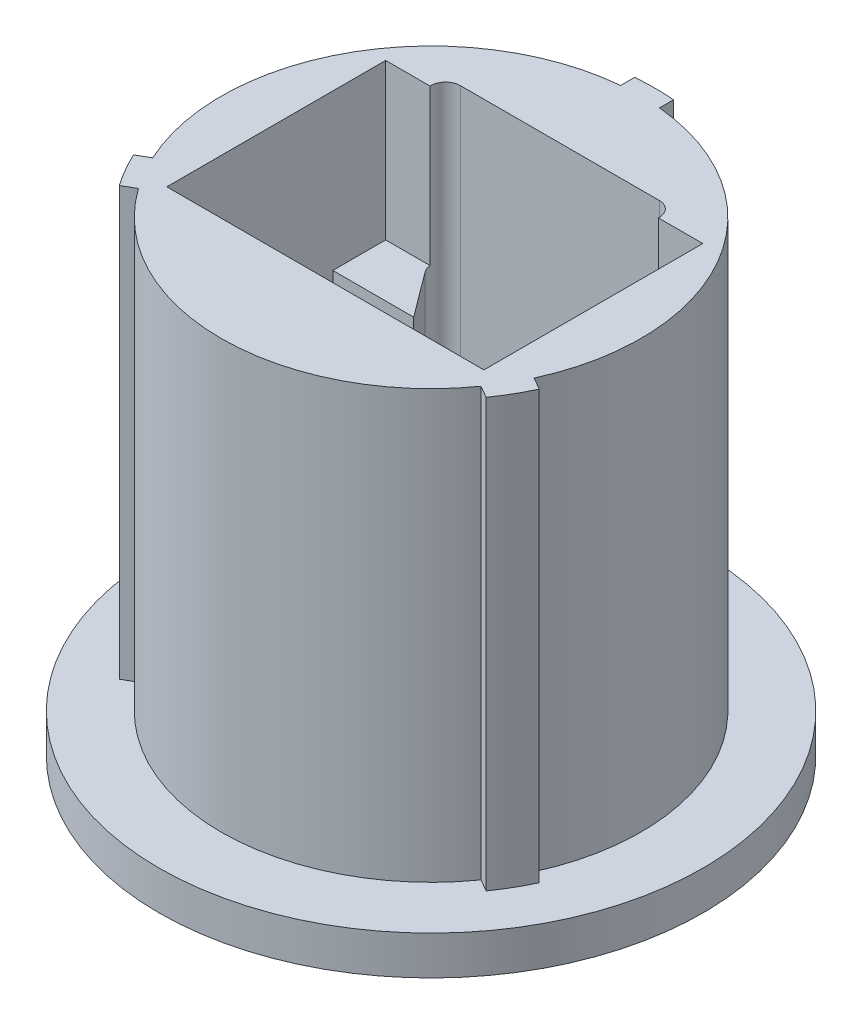
ISO-10303-21;
HEADER;
FILE_DESCRIPTION(('STEP AP214'),'2;1');
FILE_NAME('part.step','',(''),(''),'','','');
FILE_SCHEMA(('AUTOMOTIVE_DESIGN { 1 0 10303 214 1 1 1 1 }'));
ENDSEC;
DATA;
#1=APPLICATION_CONTEXT('core data for automotive mechanical design processes');
#2=APPLICATION_PROTOCOL_DEFINITION('international standard','automotive_design',2000,#1);
#3=PRODUCT_CONTEXT('',#1,'mechanical');
#4=PRODUCT('Part','Part','',(#3));
#5=PRODUCT_RELATED_PRODUCT_CATEGORY('part','',(#4));
#6=PRODUCT_DEFINITION_FORMATION('','',#4);
#7=PRODUCT_DEFINITION_CONTEXT('part definition',#1,'design');
#8=PRODUCT_DEFINITION('design','',#6,#7);
#9=PRODUCT_DEFINITION_SHAPE('','',#8);
#10=(LENGTH_UNIT() NAMED_UNIT(*) SI_UNIT(.MILLI.,.METRE.));
#11=(NAMED_UNIT(*) PLANE_ANGLE_UNIT() SI_UNIT($,.RADIAN.));
#12=(NAMED_UNIT(*) SI_UNIT($,.STERADIAN.) SOLID_ANGLE_UNIT());
#13=UNCERTAINTY_MEASURE_WITH_UNIT(LENGTH_MEASURE(1.E-05),#10,'distance_accuracy_value','');
#14=(GEOMETRIC_REPRESENTATION_CONTEXT(3) GLOBAL_UNCERTAINTY_ASSIGNED_CONTEXT((#13)) GLOBAL_UNIT_ASSIGNED_CONTEXT((#10,
#11,#12)) REPRESENTATION_CONTEXT('',''));
#15=CARTESIAN_POINT('',(0.,0.,0.));
#16=DIRECTION('',(0.,0.,1.));
#17=DIRECTION('',(1.,0.,0.));
#18=AXIS2_PLACEMENT_3D('',#15,#16,#17);
#19=CARTESIAN_POINT('',(0.,0.793750000000003,-0.762));
#20=DIRECTION('',(0.,0.,1.));
#21=DIRECTION('',(1.,0.,0.));
#22=AXIS2_PLACEMENT_3D('',#19,#20,#21);
#23=PLANE('',#22);
#24=DIRECTION('',(-1.,0.,0.));
#25=VECTOR('',#24,1.);
#26=CARTESIAN_POINT('',(-6.477,12.7,-0.762));
#27=LINE('',#26,#25);
#28=CARTESIAN_POINT('',(6.477,12.7,-0.762));
#29=VERTEX_POINT('',#28);
#30=CARTESIAN_POINT('',(-6.477,12.7,-0.762));
#31=VERTEX_POINT('',#30);
#32=EDGE_CURVE('E56',#29,#31,#27,.T.);
#33=ORIENTED_EDGE('',*,*,#32,.F.);
#34=DIRECTION('',(0.,1.,0.));
#35=VECTOR('',#34,1.);
#36=CARTESIAN_POINT('',(6.477,0.793750000000003,-0.762));
#37=LINE('',#36,#35);
#38=CARTESIAN_POINT('',(6.477,0.793750000000003,-0.762));
#39=VERTEX_POINT('',#38);
#40=EDGE_CURVE('E329',#39,#29,#37,.T.);
#41=ORIENTED_EDGE('',*,*,#40,.F.);
#42=DIRECTION('',(1.,0.,0.));
#43=VECTOR('',#42,1.);
#44=CARTESIAN_POINT('',(0.,0.793750000000003,-0.762));
#45=LINE('',#44,#43);
#46=CARTESIAN_POINT('',(-6.477,0.793750000000003,-0.762));
#47=VERTEX_POINT('',#46);
#48=EDGE_CURVE('E323',#47,#39,#45,.T.);
#49=ORIENTED_EDGE('',*,*,#48,.F.);
#50=DIRECTION('',(0.,1.,0.));
#51=VECTOR('',#50,1.);
#52=CARTESIAN_POINT('',(-6.477,0.793750000000003,-0.762));
#53=LINE('',#52,#51);
#54=EDGE_CURVE('E333',#47,#31,#53,.T.);
#55=ORIENTED_EDGE('',*,*,#54,.T.);
#56=EDGE_LOOP('',(#33,#41,#49,#55));
#57=FACE_BOUND('',#56,.T.);
#58=ADVANCED_FACE('F33',(#57),#23,.F.);
#59=CARTESIAN_POINT('',(0.,0.,0.));
#60=DIRECTION('',(0.,1.,0.));
#61=DIRECTION('',(0.,0.,1.));
#62=AXIS2_PLACEMENT_3D('',#59,#60,#61);
#63=PLANE('',#62);
#64=CARTESIAN_POINT('',(4.064,0.,-4.65997487874299));
#65=DIRECTION('',(0.,1.,0.));
#66=DIRECTION('',(0.,0.,1.));
#67=AXIS2_PLACEMENT_3D('',#64,#65,#66);
#68=CIRCLE('',#67,0.597825121257013);
#69=CARTESIAN_POINT('',(4.064,0.,-5.2578));
#70=VERTEX_POINT('',#69);
#71=CARTESIAN_POINT('',(4.54361534772605,0.,-4.30309395485999));
#72=VERTEX_POINT('',#71);
#73=EDGE_CURVE('E343',#70,#72,#68,.F.);
#74=ORIENTED_EDGE('',*,*,#73,.F.);
#75=DIRECTION('',(1.,0.,0.));
#76=VECTOR('',#75,1.);
#77=CARTESIAN_POINT('',(0.,0.,-5.2578));
#78=LINE('',#77,#76);
#79=CARTESIAN_POINT('',(-4.064,0.,-5.2578));
#80=VERTEX_POINT('',#79);
#81=EDGE_CURVE('E345',#80,#70,#78,.T.);
#82=ORIENTED_EDGE('',*,*,#81,.F.);
#83=CARTESIAN_POINT('',(-4.064,0.,-4.65997487874299));
#84=DIRECTION('',(0.,1.,0.));
#85=DIRECTION('',(0.,0.,1.));
#86=AXIS2_PLACEMENT_3D('',#83,#84,#85);
#87=CIRCLE('',#86,0.597825121257012);
#88=CARTESIAN_POINT('',(-4.54361534772606,0.,-4.30309395485999));
#89=VERTEX_POINT('',#88);
#90=EDGE_CURVE('E348',#89,#80,#87,.F.);
#91=ORIENTED_EDGE('',*,*,#90,.F.);
#92=DIRECTION('',(-0.596965418804419,0.,-0.802266968503418));
#93=VECTOR('',#92,1.);
#94=CARTESIAN_POINT('',(-0.863555532726361,0.,0.642570130011116));
#95=LINE('',#94,#93);
#96=CARTESIAN_POINT('',(-3.175,0.,-2.4638));
#97=VERTEX_POINT('',#96);
#98=EDGE_CURVE('E351',#97,#89,#95,.T.);
#99=ORIENTED_EDGE('',*,*,#98,.F.);
#100=DIRECTION('',(1.,0.,0.));
#101=VECTOR('',#100,1.);
#102=CARTESIAN_POINT('',(0.,0.,-2.4638));
#103=LINE('',#102,#101);
#104=CARTESIAN_POINT('',(3.175,0.,-2.4638));
#105=VERTEX_POINT('',#104);
#106=EDGE_CURVE('E353',#97,#105,#103,.T.);
#107=ORIENTED_EDGE('',*,*,#106,.T.);
#108=DIRECTION('',(-0.596965418804419,0.,0.802266968503418));
#109=VECTOR('',#108,1.);
#110=CARTESIAN_POINT('',(0.863555532726356,0.,0.642570130011112));
#111=LINE('',#110,#109);
#112=EDGE_CURVE('E356',#72,#105,#111,.T.);
#113=ORIENTED_EDGE('',*,*,#112,.F.);
#114=EDGE_LOOP('',(#74,#82,#91,#99,#107,#113));
#115=FACE_BOUND('',#114,.T.);
#116=CARTESIAN_POINT('',(0.,0.,0.));
#117=DIRECTION('',(0.,1.,0.));
#118=DIRECTION('',(0.,0.,1.));
#119=AXIS2_PLACEMENT_3D('',#116,#117,#118);
#120=CIRCLE('',#119,11.1125);
#121=CARTESIAN_POINT('',(0.,0.,11.1125));
#122=VERTEX_POINT('',#121);
#123=EDGE_CURVE('E282',#122,#122,#120,.T.);
#124=ORIENTED_EDGE('',*,*,#123,.F.);
#125=EDGE_LOOP('',(#124));
#126=FACE_BOUND('',#125,.T.);
#127=ADVANCED_FACE('F503',(#115,#126),#63,.F.);
#128=CARTESIAN_POINT('',(0.,19.05,0.));
#129=DIRECTION('',(0.,-1.,0.));
#130=DIRECTION('',(0.,0.,-1.));
#131=AXIS2_PLACEMENT_3D('',#128,#129,#130);
#132=CYLINDRICAL_SURFACE('',#131,9.144);
#133=CARTESIAN_POINT('',(0.,1.58750000000001,0.));
#134=DIRECTION('',(0.,1.,0.));
#135=DIRECTION('',(0.,0.,1.));
#136=AXIS2_PLACEMENT_3D('',#133,#134,#135);
#137=CIRCLE('',#136,9.144);
#138=CARTESIAN_POINT('',(0.793749999999991,1.58750000000002,-9.10948390072127));
#139=VERTEX_POINT('',#138);
#140=CARTESIAN_POINT('',(-0.793750000000006,1.58750000000001,-9.10948390072127));
#141=VERTEX_POINT('',#140);
#142=EDGE_CURVE('E289',#139,#141,#137,.T.);
#143=ORIENTED_EDGE('',*,*,#142,.T.);
#144=DIRECTION('',(0.,-1.,0.));
#145=VECTOR('',#144,1.);
#146=CARTESIAN_POINT('',(-0.793750000000006,19.05,-9.10948390072127));
#147=LINE('',#146,#145);
#148=CARTESIAN_POINT('',(-0.793750000000006,19.05,-9.10948390072127));
#149=VERTEX_POINT('',#148);
#150=EDGE_CURVE('E440',#149,#141,#147,.T.);
#151=ORIENTED_EDGE('',*,*,#150,.F.);
#152=CARTESIAN_POINT('',(0.,19.05,0.));
#153=DIRECTION('',(0.,1.,0.));
#154=DIRECTION('',(0.,0.,1.));
#155=AXIS2_PLACEMENT_3D('',#152,#153,#154);
#156=CIRCLE('',#155,9.144);
#157=CARTESIAN_POINT('',(0.793749999999991,19.05,-9.10948390072127));
#158=VERTEX_POINT('',#157);
#159=EDGE_CURVE('E368',#158,#149,#156,.T.);
#160=ORIENTED_EDGE('',*,*,#159,.F.);
#161=DIRECTION('',(0.,-1.,0.));
#162=VECTOR('',#161,1.);
#163=CARTESIAN_POINT('',(0.793749999999991,19.05,-9.10948390072127));
#164=LINE('',#163,#162);
#165=EDGE_CURVE('E408',#158,#139,#164,.T.);
#166=ORIENTED_EDGE('',*,*,#165,.T.);
#167=EDGE_LOOP('',(#143,#151,#160,#166));
#168=FACE_BOUND('',#167,.T.);
#169=ADVANCED_FACE('F35',(#168),#132,.T.);
#170=CARTESIAN_POINT('',(-0.793750000000006,19.05,-9.10948390072127));
#171=DIRECTION('',(1.,0.,3.15542680651737E-13));
#172=DIRECTION('',(3.15542680651737E-13,0.,-1.));
#173=AXIS2_PLACEMENT_3D('',#170,#171,#172);
#174=PLANE('',#173);
#175=DIRECTION('',(3.15542680651737E-13,0.,-1.));
#176=VECTOR('',#175,1.);
#177=CARTESIAN_POINT('',(-0.793750000000006,1.58750000000001,-9.10948390072127));
#178=LINE('',#177,#176);
#179=CARTESIAN_POINT('',(-0.793750000000187,1.58750000000001,-8.53567321231897));
#180=VERTEX_POINT('',#179);
#181=EDGE_CURVE('E310',#180,#141,#178,.T.);
#182=ORIENTED_EDGE('',*,*,#181,.F.);
#183=DIRECTION('',(0.,-1.,0.));
#184=VECTOR('',#183,1.);
#185=CARTESIAN_POINT('',(-0.793750000000187,19.05,-8.53567321231897));
#186=LINE('',#185,#184);
#187=CARTESIAN_POINT('',(-0.793750000000187,19.05,-8.53567321231897));
#188=VERTEX_POINT('',#187);
#189=EDGE_CURVE('E437',#188,#180,#186,.T.);
#190=ORIENTED_EDGE('',*,*,#189,.F.);
#191=DIRECTION('',(-3.15542680651737E-13,0.,1.));
#192=VECTOR('',#191,1.);
#193=CARTESIAN_POINT('',(-0.793750000000006,19.05,-9.10948390072127));
#194=LINE('',#193,#192);
#195=EDGE_CURVE('E386',#149,#188,#194,.T.);
#196=ORIENTED_EDGE('',*,*,#195,.F.);
#197=ORIENTED_EDGE('',*,*,#150,.T.);
#198=EDGE_LOOP('',(#182,#190,#196,#197));
#199=FACE_BOUND('',#198,.T.);
#200=ADVANCED_FACE('F496',(#199),#174,.F.);
#201=CARTESIAN_POINT('',(0.,19.05,0.));
#202=DIRECTION('',(0.,-1.,0.));
#203=DIRECTION('',(0.,0.,-1.));
#204=AXIS2_PLACEMENT_3D('',#201,#202,#203);
#205=CYLINDRICAL_SURFACE('',#204,8.5725);
#206=CARTESIAN_POINT('',(0.,1.58750000000001,0.));
#207=DIRECTION('',(0.,-1.,0.));
#208=DIRECTION('',(0.,0.,-1.));
#209=AXIS2_PLACEMENT_3D('',#206,#207,#208);
#210=CIRCLE('',#209,8.5725);
#211=CARTESIAN_POINT('',(-7.78898484027049,1.58750000000001,3.58042894190577));
#212=VERTEX_POINT('',#211);
#213=EDGE_CURVE('E307',#212,#180,#210,.T.);
#214=ORIENTED_EDGE('',*,*,#213,.F.);
#215=DIRECTION('',(0.,-1.,0.));
#216=VECTOR('',#215,1.);
#217=CARTESIAN_POINT('',(-7.78898484027049,19.05,3.58042894190577));
#218=LINE('',#217,#216);
#219=CARTESIAN_POINT('',(-7.78898484027049,19.05,3.58042894190577));
#220=VERTEX_POINT('',#219);
#221=EDGE_CURVE('E434',#220,#212,#218,.T.);
#222=ORIENTED_EDGE('',*,*,#221,.F.);
#223=CARTESIAN_POINT('',(0.,19.05,0.));
#224=DIRECTION('',(0.,1.,0.));
#225=DIRECTION('',(0.,0.,1.));
#226=AXIS2_PLACEMENT_3D('',#223,#224,#225);
#227=CIRCLE('',#226,8.5725);
#228=EDGE_CURVE('E388',#188,#220,#227,.T.);
#229=ORIENTED_EDGE('',*,*,#228,.F.);
#230=ORIENTED_EDGE('',*,*,#189,.T.);
#231=EDGE_LOOP('',(#214,#222,#229,#230));
#232=FACE_BOUND('',#231,.T.);
#233=ADVANCED_FACE('F493',(#232),#205,.T.);
#234=CARTESIAN_POINT('',(-8.28591947338998,19.05,3.86733428610674));
#235=DIRECTION('',(0.499999999999724,0.,0.866025403784598));
#236=DIRECTION('',(0.866025403784598,0.,-0.499999999999724));
#237=AXIS2_PLACEMENT_3D('',#234,#235,#236);
#238=PLANE('',#237);
#239=DIRECTION('',(0.866025403784598,0.,-0.499999999999724));
#240=VECTOR('',#239,1.);
#241=CARTESIAN_POINT('',(-8.28591947338998,1.58750000000001,3.86733428610674));
#242=LINE('',#241,#240);
#243=CARTESIAN_POINT('',(-8.28591947338998,1.58750000000001,3.86733428610675));
#244=VERTEX_POINT('',#243);
#245=EDGE_CURVE('E304',#244,#212,#242,.T.);
#246=ORIENTED_EDGE('',*,*,#245,.F.);
#247=DIRECTION('',(0.,-1.,0.));
#248=VECTOR('',#247,1.);
#249=CARTESIAN_POINT('',(-8.28591947338998,19.05,3.86733428610674));
#250=LINE('',#249,#248);
#251=CARTESIAN_POINT('',(-8.28591947338998,19.05,3.86733428610674));
#252=VERTEX_POINT('',#251);
#253=EDGE_CURVE('E431',#252,#244,#250,.T.);
#254=ORIENTED_EDGE('',*,*,#253,.F.);
#255=DIRECTION('',(-0.866025403784598,0.,0.499999999999724));
#256=VECTOR('',#255,1.);
#257=CARTESIAN_POINT('',(-8.28591947338998,19.05,3.86733428610674));
#258=LINE('',#257,#256);
#259=EDGE_CURVE('E390',#220,#252,#258,.T.);
#260=ORIENTED_EDGE('',*,*,#259,.F.);
#261=ORIENTED_EDGE('',*,*,#221,.T.);
#262=EDGE_LOOP('',(#246,#254,#260,#261));
#263=FACE_BOUND('',#262,.T.);
#264=ADVANCED_FACE('F490',(#263),#238,.F.);
#265=CARTESIAN_POINT('',(0.,19.05,0.));
#266=DIRECTION('',(0.,-1.,0.));
#267=DIRECTION('',(0.,0.,-1.));
#268=AXIS2_PLACEMENT_3D('',#265,#266,#267);
#269=CYLINDRICAL_SURFACE('',#268,9.144);
#270=CARTESIAN_POINT('',(-7.49216947338998,1.58750000000001,5.24214961461454));
#271=VERTEX_POINT('',#270);
#272=EDGE_CURVE('E285',#244,#271,#137,.T.);
#273=ORIENTED_EDGE('',*,*,#272,.T.);
#274=DIRECTION('',(0.,-1.,0.));
#275=VECTOR('',#274,1.);
#276=CARTESIAN_POINT('',(-7.49216947338997,19.05,5.24214961461454));
#277=LINE('',#276,#275);
#278=CARTESIAN_POINT('',(-7.49216947338997,19.05,5.24214961461454));
#279=VERTEX_POINT('',#278);
#280=EDGE_CURVE('E428',#279,#271,#277,.T.);
#281=ORIENTED_EDGE('',*,*,#280,.F.);
#282=CARTESIAN_POINT('',(0.,19.05,0.));
#283=DIRECTION('',(0.,1.,0.));
#284=DIRECTION('',(0.,0.,1.));
#285=AXIS2_PLACEMENT_3D('',#282,#283,#284);
#286=CIRCLE('',#285,9.144);
#287=EDGE_CURVE('E392',#252,#279,#286,.T.);
#288=ORIENTED_EDGE('',*,*,#287,.F.);
#289=ORIENTED_EDGE('',*,*,#253,.T.);
#290=EDGE_LOOP('',(#273,#281,#288,#289));
#291=FACE_BOUND('',#290,.T.);
#292=ADVANCED_FACE('F486',(#291),#269,.T.);
#293=CARTESIAN_POINT('',(-7.49216947338998,19.05,5.24214961461454));
#294=DIRECTION('',(-0.499999999999723,0.,-0.866025403784599));
#295=DIRECTION('',(-0.866025403784599,0.,0.499999999999723));
#296=AXIS2_PLACEMENT_3D('',#293,#294,#295);
#297=PLANE('',#296);
#298=DIRECTION('',(-0.866025403784599,0.,0.499999999999723));
#299=VECTOR('',#298,1.);
#300=CARTESIAN_POINT('',(-7.49216947338998,1.58750000000001,5.24214961461454));
#301=LINE('',#300,#299);
#302=CARTESIAN_POINT('',(-6.99523484027046,1.58750000000001,4.95524427041355));
#303=VERTEX_POINT('',#302);
#304=EDGE_CURVE('E301',#303,#271,#301,.T.);
#305=ORIENTED_EDGE('',*,*,#304,.F.);
#306=DIRECTION('',(0.,-1.,0.));
#307=VECTOR('',#306,1.);
#308=CARTESIAN_POINT('',(-6.99523484027046,19.05,4.95524427041355));
#309=LINE('',#308,#307);
#310=CARTESIAN_POINT('',(-6.99523484027046,19.05,4.95524427041355));
#311=VERTEX_POINT('',#310);
#312=EDGE_CURVE('E425',#311,#303,#309,.T.);
#313=ORIENTED_EDGE('',*,*,#312,.F.);
#314=DIRECTION('',(0.866025403784599,0.,-0.499999999999723));
#315=VECTOR('',#314,1.);
#316=CARTESIAN_POINT('',(-7.49216947338998,19.05,5.24214961461454));
#317=LINE('',#316,#315);
#318=EDGE_CURVE('E394',#279,#311,#317,.T.);
#319=ORIENTED_EDGE('',*,*,#318,.F.);
#320=ORIENTED_EDGE('',*,*,#280,.T.);
#321=EDGE_LOOP('',(#305,#313,#319,#320));
#322=FACE_BOUND('',#321,.T.);
#323=ADVANCED_FACE('F481',(#322),#297,.F.);
#324=CARTESIAN_POINT('',(0.,19.05,0.));
#325=DIRECTION('',(0.,-1.,0.));
#326=DIRECTION('',(0.,0.,-1.));
#327=AXIS2_PLACEMENT_3D('',#324,#325,#326);
#328=CYLINDRICAL_SURFACE('',#327,8.5725);
#329=CARTESIAN_POINT('',(0.,1.58750000000001,0.));
#330=DIRECTION('',(0.,-1.,0.));
#331=DIRECTION('',(0.,0.,-1.));
#332=AXIS2_PLACEMENT_3D('',#329,#330,#331);
#333=CIRCLE('',#332,8.5725);
#334=CARTESIAN_POINT('',(6.99523484027068,1.58750000000001,4.95524427041324));
#335=VERTEX_POINT('',#334);
#336=EDGE_CURVE('E298',#335,#303,#333,.T.);
#337=ORIENTED_EDGE('',*,*,#336,.F.);
#338=DIRECTION('',(0.,-1.,0.));
#339=VECTOR('',#338,1.);
#340=CARTESIAN_POINT('',(6.99523484027068,19.05,4.95524427041324));
#341=LINE('',#340,#339);
#342=CARTESIAN_POINT('',(6.99523484027068,19.05,4.95524427041324));
#343=VERTEX_POINT('',#342);
#344=EDGE_CURVE('E422',#343,#335,#341,.T.);
#345=ORIENTED_EDGE('',*,*,#344,.F.);
#346=CARTESIAN_POINT('',(0.,19.05,0.));
#347=DIRECTION('',(0.,1.,0.));
#348=DIRECTION('',(0.,0.,1.));
#349=AXIS2_PLACEMENT_3D('',#346,#347,#348);
#350=CIRCLE('',#349,8.5725);
#351=EDGE_CURVE('E396',#311,#343,#350,.T.);
#352=ORIENTED_EDGE('',*,*,#351,.F.);
#353=ORIENTED_EDGE('',*,*,#312,.T.);
#354=EDGE_LOOP('',(#337,#345,#352,#353));
#355=FACE_BOUND('',#354,.T.);
#356=ADVANCED_FACE('F477',(#355),#328,.T.);
#357=CARTESIAN_POINT('',(7.49216947338998,19.05,5.24214961461453));
#358=DIRECTION('',(0.500000000000273,0.,-0.866025403784281));
#359=DIRECTION('',(-0.866025403784281,0.,-0.500000000000273));
#360=AXIS2_PLACEMENT_3D('',#357,#358,#359);
#361=PLANE('',#360);
#362=DIRECTION('',(-0.866025403784281,0.,-0.500000000000273));
#363=VECTOR('',#362,1.);
#364=CARTESIAN_POINT('',(7.49216947338998,1.58750000000001,5.24214961461453));
#365=LINE('',#364,#363);
#366=CARTESIAN_POINT('',(7.49216947338998,1.58750000000001,5.24214961461453));
#367=VERTEX_POINT('',#366);
#368=EDGE_CURVE('E295',#367,#335,#365,.T.);
#369=ORIENTED_EDGE('',*,*,#368,.F.);
#370=DIRECTION('',(0.,-1.,0.));
#371=VECTOR('',#370,1.);
#372=CARTESIAN_POINT('',(7.49216947338998,19.05,5.24214961461453));
#373=LINE('',#372,#371);
#374=CARTESIAN_POINT('',(7.49216947338998,19.05,5.24214961461453));
#375=VERTEX_POINT('',#374);
#376=EDGE_CURVE('E419',#375,#367,#373,.T.);
#377=ORIENTED_EDGE('',*,*,#376,.F.);
#378=DIRECTION('',(0.866025403784281,0.,0.500000000000273));
#379=VECTOR('',#378,1.);
#380=CARTESIAN_POINT('',(7.49216947338998,19.05,5.24214961461453));
#381=LINE('',#380,#379);
#382=EDGE_CURVE('E398',#343,#375,#381,.T.);
#383=ORIENTED_EDGE('',*,*,#382,.F.);
#384=ORIENTED_EDGE('',*,*,#344,.T.);
#385=EDGE_LOOP('',(#369,#377,#383,#384));
#386=FACE_BOUND('',#385,.T.);
#387=ADVANCED_FACE('F473',(#386),#361,.F.);
#388=CARTESIAN_POINT('',(0.,19.05,0.));
#389=DIRECTION('',(0.,-1.,0.));
#390=DIRECTION('',(0.,0.,-1.));
#391=AXIS2_PLACEMENT_3D('',#388,#389,#390);
#392=CYLINDRICAL_SURFACE('',#391,9.144);
#393=CARTESIAN_POINT('',(8.28591947338998,1.58750000000001,3.86733428610673));
#394=VERTEX_POINT('',#393);
#395=EDGE_CURVE('E286',#367,#394,#137,.T.);
#396=ORIENTED_EDGE('',*,*,#395,.T.);
#397=DIRECTION('',(0.,-1.,0.));
#398=VECTOR('',#397,1.);
#399=CARTESIAN_POINT('',(8.28591947338998,19.05,3.86733428610673));
#400=LINE('',#399,#398);
#401=CARTESIAN_POINT('',(8.28591947338998,19.05,3.86733428610673));
#402=VERTEX_POINT('',#401);
#403=EDGE_CURVE('E416',#402,#394,#400,.T.);
#404=ORIENTED_EDGE('',*,*,#403,.F.);
#405=CARTESIAN_POINT('',(0.,19.05,0.));
#406=DIRECTION('',(0.,1.,0.));
#407=DIRECTION('',(0.,0.,1.));
#408=AXIS2_PLACEMENT_3D('',#405,#406,#407);
#409=CIRCLE('',#408,9.144);
#410=EDGE_CURVE('E400',#375,#402,#409,.T.);
#411=ORIENTED_EDGE('',*,*,#410,.F.);
#412=ORIENTED_EDGE('',*,*,#376,.T.);
#413=EDGE_LOOP('',(#396,#404,#411,#412));
#414=FACE_BOUND('',#413,.T.);
#415=ADVANCED_FACE('F468',(#414),#392,.T.);
#416=CARTESIAN_POINT('',(8.28591947338998,19.05,3.86733428610673));
#417=DIRECTION('',(-0.500000000000288,0.,0.866025403784272));
#418=DIRECTION('',(0.866025403784273,0.,0.500000000000288));
#419=AXIS2_PLACEMENT_3D('',#416,#417,#418);
#420=PLANE('',#419);
#421=DIRECTION('',(0.866025403784273,0.,0.500000000000288));
#422=VECTOR('',#421,1.);
#423=CARTESIAN_POINT('',(8.28591947338998,1.58750000000001,3.86733428610673));
#424=LINE('',#423,#422);
#425=CARTESIAN_POINT('',(7.78898484027065,1.58750000000001,3.58042894190542));
#426=VERTEX_POINT('',#425);
#427=EDGE_CURVE('E292',#426,#394,#424,.T.);
#428=ORIENTED_EDGE('',*,*,#427,.F.);
#429=DIRECTION('',(0.,-1.,0.));
#430=VECTOR('',#429,1.);
#431=CARTESIAN_POINT('',(7.78898484027065,19.05,3.58042894190542));
#432=LINE('',#431,#430);
#433=CARTESIAN_POINT('',(7.78898484027065,19.05,3.58042894190542));
#434=VERTEX_POINT('',#433);
#435=EDGE_CURVE('E413',#434,#426,#432,.T.);
#436=ORIENTED_EDGE('',*,*,#435,.F.);
#437=DIRECTION('',(-0.866025403784273,0.,-0.500000000000288));
#438=VECTOR('',#437,1.);
#439=CARTESIAN_POINT('',(8.28591947338998,19.05,3.86733428610673));
#440=LINE('',#439,#438);
#441=EDGE_CURVE('E402',#402,#434,#440,.T.);
#442=ORIENTED_EDGE('',*,*,#441,.F.);
#443=ORIENTED_EDGE('',*,*,#403,.T.);
#444=EDGE_LOOP('',(#428,#436,#442,#443));
#445=FACE_BOUND('',#444,.T.);
#446=ADVANCED_FACE('F464',(#445),#420,.F.);
#447=CARTESIAN_POINT('',(0.,19.05,0.));
#448=DIRECTION('',(0.,-1.,0.));
#449=DIRECTION('',(0.,0.,-1.));
#450=AXIS2_PLACEMENT_3D('',#447,#448,#449);
#451=CYLINDRICAL_SURFACE('',#450,8.5725);
#452=CARTESIAN_POINT('',(0.,1.58750000000001,0.));
#453=DIRECTION('',(0.,-1.,0.));
#454=DIRECTION('',(0.,0.,-1.));
#455=AXIS2_PLACEMENT_3D('',#452,#453,#454);
#456=CIRCLE('',#455,8.5725);
#457=CARTESIAN_POINT('',(0.793749999999813,1.58750000000001,-8.53567321231901));
#458=VERTEX_POINT('',#457);
#459=EDGE_CURVE('E288',#458,#426,#456,.T.);
#460=ORIENTED_EDGE('',*,*,#459,.F.);
#461=DIRECTION('',(0.,-1.,0.));
#462=VECTOR('',#461,1.);
#463=CARTESIAN_POINT('',(0.793749999999815,19.05,-8.53567321231901));
#464=LINE('',#463,#462);
#465=CARTESIAN_POINT('',(0.793749999999815,19.05,-8.53567321231901));
#466=VERTEX_POINT('',#465);
#467=EDGE_CURVE('E411',#466,#458,#464,.T.);
#468=ORIENTED_EDGE('',*,*,#467,.F.);
#469=CARTESIAN_POINT('',(0.,19.05,0.));
#470=DIRECTION('',(0.,1.,0.));
#471=DIRECTION('',(0.,0.,1.));
#472=AXIS2_PLACEMENT_3D('',#469,#470,#471);
#473=CIRCLE('',#472,8.5725);
#474=EDGE_CURVE('E404',#434,#466,#473,.T.);
#475=ORIENTED_EDGE('',*,*,#474,.F.);
#476=ORIENTED_EDGE('',*,*,#435,.T.);
#477=EDGE_LOOP('',(#460,#468,#475,#476));
#478=FACE_BOUND('',#477,.T.);
#479=ADVANCED_FACE('F462',(#478),#451,.T.);
#480=CARTESIAN_POINT('',(0.793749999999991,19.05,-9.10948390072127));
#481=DIRECTION('',(-1.,0.,-3.11196883253559E-13));
#482=DIRECTION('',(-3.11196883253559E-13,0.,1.));
#483=AXIS2_PLACEMENT_3D('',#480,#481,#482);
#484=PLANE('',#483);
#485=DIRECTION('',(-3.11196883253559E-13,0.,1.));
#486=VECTOR('',#485,1.);
#487=CARTESIAN_POINT('',(0.793749999999991,1.58750000000001,-9.10948390072127));
#488=LINE('',#487,#486);
#489=EDGE_CURVE('E41',#139,#458,#488,.T.);
#490=ORIENTED_EDGE('',*,*,#489,.F.);
#491=ORIENTED_EDGE('',*,*,#165,.F.);
#492=DIRECTION('',(3.11196883253559E-13,0.,-1.));
#493=VECTOR('',#492,1.);
#494=CARTESIAN_POINT('',(0.793749999999991,19.05,-9.10948390072127));
#495=LINE('',#494,#493);
#496=EDGE_CURVE('E406',#466,#158,#495,.T.);
#497=ORIENTED_EDGE('',*,*,#496,.F.);
#498=ORIENTED_EDGE('',*,*,#467,.T.);
#499=EDGE_LOOP('',(#490,#491,#497,#498));
#500=FACE_BOUND('',#499,.T.);
#501=ADVANCED_FACE('F449',(#500),#484,.F.);
#502=CARTESIAN_POINT('',(0.,19.05,0.));
#503=DIRECTION('',(0.,1.,0.));
#504=DIRECTION('',(0.,0.,1.));
#505=AXIS2_PLACEMENT_3D('',#502,#503,#504);
#506=PLANE('',#505);
#507=DIRECTION('',(1.,0.,0.));
#508=VECTOR('',#507,1.);
#509=CARTESIAN_POINT('',(-6.477,19.05,4.318));
#510=LINE('',#509,#508);
#511=CARTESIAN_POINT('',(-6.477,19.05,4.318));
#512=VERTEX_POINT('',#511);
#513=CARTESIAN_POINT('',(6.477,19.05,4.318));
#514=VERTEX_POINT('',#513);
#515=EDGE_CURVE('E244',#512,#514,#510,.T.);
#516=ORIENTED_EDGE('',*,*,#515,.F.);
#517=DIRECTION('',(0.,0.,1.));
#518=VECTOR('',#517,1.);
#519=CARTESIAN_POINT('',(-6.477,19.05,0.));
#520=LINE('',#519,#518);
#521=CARTESIAN_POINT('',(-6.477,19.05,-4.6228));
#522=VERTEX_POINT('',#521);
#523=EDGE_CURVE('E230',#522,#512,#520,.T.);
#524=ORIENTED_EDGE('',*,*,#523,.F.);
#525=DIRECTION('',(-1.,0.,0.));
#526=VECTOR('',#525,1.);
#527=CARTESIAN_POINT('',(-6.477,19.05,-4.6228));
#528=LINE('',#527,#526);
#529=CARTESIAN_POINT('',(-4.66066816908262,19.05,-4.6228));
#530=VERTEX_POINT('',#529);
#531=EDGE_CURVE('E266',#530,#522,#528,.T.);
#532=ORIENTED_EDGE('',*,*,#531,.F.);
#533=CARTESIAN_POINT('',(-4.064,19.05,-4.65997487874299));
#534=DIRECTION('',(0.,1.,0.));
#535=DIRECTION('',(0.,0.,1.));
#536=AXIS2_PLACEMENT_3D('',#533,#534,#535);
#537=CIRCLE('',#536,0.597825121257012);
#538=CARTESIAN_POINT('',(-4.064,19.05,-5.2578));
#539=VERTEX_POINT('',#538);
#540=EDGE_CURVE('E346',#530,#539,#537,.F.);
#541=ORIENTED_EDGE('',*,*,#540,.T.);
#542=DIRECTION('',(1.,0.,0.));
#543=VECTOR('',#542,1.);
#544=CARTESIAN_POINT('',(0.,19.05,-5.2578));
#545=LINE('',#544,#543);
#546=CARTESIAN_POINT('',(4.064,19.05,-5.2578));
#547=VERTEX_POINT('',#546);
#548=EDGE_CURVE('E361',#539,#547,#545,.T.);
#549=ORIENTED_EDGE('',*,*,#548,.T.);
#550=CARTESIAN_POINT('',(4.064,19.05,-4.65997487874299));
#551=DIRECTION('',(0.,1.,0.));
#552=DIRECTION('',(0.,0.,1.));
#553=AXIS2_PLACEMENT_3D('',#550,#551,#552);
#554=CIRCLE('',#553,0.597825121257013);
#555=CARTESIAN_POINT('',(4.66066816908262,19.05,-4.6228));
#556=VERTEX_POINT('',#555);
#557=EDGE_CURVE('E342',#547,#556,#554,.F.);
#558=ORIENTED_EDGE('',*,*,#557,.T.);
#559=CARTESIAN_POINT('',(6.477,19.05,-4.6228));
#560=VERTEX_POINT('',#559);
#561=EDGE_CURVE('E256',#560,#556,#528,.T.);
#562=ORIENTED_EDGE('',*,*,#561,.F.);
#563=DIRECTION('',(0.,0.,1.));
#564=VECTOR('',#563,1.);
#565=CARTESIAN_POINT('',(6.477,19.05,0.));
#566=LINE('',#565,#564);
#567=EDGE_CURVE('E313',#560,#514,#566,.T.);
#568=ORIENTED_EDGE('',*,*,#567,.T.);
#569=EDGE_LOOP('',(#516,#524,#532,#541,#549,#558,#562,#568));
#570=FACE_BOUND('',#569,.T.);
#571=ORIENTED_EDGE('',*,*,#159,.T.);
#572=ORIENTED_EDGE('',*,*,#195,.T.);
#573=ORIENTED_EDGE('',*,*,#228,.T.);
#574=ORIENTED_EDGE('',*,*,#259,.T.);
#575=ORIENTED_EDGE('',*,*,#287,.T.);
#576=ORIENTED_EDGE('',*,*,#318,.T.);
#577=ORIENTED_EDGE('',*,*,#351,.T.);
#578=ORIENTED_EDGE('',*,*,#382,.T.);
#579=ORIENTED_EDGE('',*,*,#410,.T.);
#580=ORIENTED_EDGE('',*,*,#441,.T.);
#581=ORIENTED_EDGE('',*,*,#474,.T.);
#582=ORIENTED_EDGE('',*,*,#496,.T.);
#583=EDGE_LOOP('',(#571,#572,#573,#574,#575,#576,#577,#578,#579,#580,#581,#582));
#584=FACE_BOUND('',#583,.T.);
#585=ADVANCED_FACE('F456',(#570,#584),#506,.T.);
#586=CARTESIAN_POINT('',(0.,0.,-2.4638));
#587=DIRECTION('',(0.,0.,1.));
#588=DIRECTION('',(1.,0.,0.));
#589=AXIS2_PLACEMENT_3D('',#586,#587,#588);
#590=PLANE('',#589);
#591=DIRECTION('',(1.,0.,0.));
#592=VECTOR('',#591,1.);
#593=CARTESIAN_POINT('',(0.,0.793750000000003,-2.4638));
#594=LINE('',#593,#592);
#595=CARTESIAN_POINT('',(-3.175,0.793750000000003,-2.4638));
#596=VERTEX_POINT('',#595);
#597=CARTESIAN_POINT('',(3.175,0.793750000000003,-2.4638));
#598=VERTEX_POINT('',#597);
#599=EDGE_CURVE('E320',#596,#598,#594,.T.);
#600=ORIENTED_EDGE('',*,*,#599,.T.);
#601=DIRECTION('',(0.,1.,0.));
#602=VECTOR('',#601,1.);
#603=CARTESIAN_POINT('',(3.175,0.,-2.4638));
#604=LINE('',#603,#602);
#605=EDGE_CURVE('E369',#105,#598,#604,.T.);
#606=ORIENTED_EDGE('',*,*,#605,.F.);
#607=ORIENTED_EDGE('',*,*,#106,.F.);
#608=DIRECTION('',(0.,1.,0.));
#609=VECTOR('',#608,1.);
#610=CARTESIAN_POINT('',(-3.175,0.,-2.4638));
#611=LINE('',#610,#609);
#612=EDGE_CURVE('E372',#97,#596,#611,.T.);
#613=ORIENTED_EDGE('',*,*,#612,.T.);
#614=EDGE_LOOP('',(#600,#606,#607,#613));
#615=FACE_BOUND('',#614,.T.);
#616=ADVANCED_FACE('F532',(#615),#590,.F.);
#617=CARTESIAN_POINT('',(4.064,0.,-4.65997487874299));
#618=DIRECTION('',(0.,1.,0.));
#619=DIRECTION('',(0.,0.,1.));
#620=AXIS2_PLACEMENT_3D('',#617,#618,#619);
#621=CYLINDRICAL_SURFACE('',#620,0.597825121257013);
#622=DIRECTION('',(0.,1.,0.));
#623=VECTOR('',#622,1.);
#624=CARTESIAN_POINT('',(4.66066816908262,0.,-4.6228));
#625=LINE('',#624,#623);
#626=CARTESIAN_POINT('',(4.66066816908262,12.7,-4.6228));
#627=VERTEX_POINT('',#626);
#628=EDGE_CURVE('E277',#556,#627,#625,.F.);
#629=ORIENTED_EDGE('',*,*,#628,.F.);
#630=ORIENTED_EDGE('',*,*,#557,.F.);
#631=DIRECTION('',(0.,1.,0.));
#632=VECTOR('',#631,1.);
#633=CARTESIAN_POINT('',(4.064,0.,-5.2578));
#634=LINE('',#633,#632);
#635=EDGE_CURVE('E358',#70,#547,#634,.T.);
#636=ORIENTED_EDGE('',*,*,#635,.F.);
#637=ORIENTED_EDGE('',*,*,#73,.T.);
#638=DIRECTION('',(0.,1.,0.));
#639=VECTOR('',#638,1.);
#640=CARTESIAN_POINT('',(4.54361534772605,0.,-4.30309395485999));
#641=LINE('',#640,#639);
#642=CARTESIAN_POINT('',(4.54361534772605,12.7,-4.30309395485999));
#643=VERTEX_POINT('',#642);
#644=EDGE_CURVE('E365',#72,#643,#641,.T.);
#645=ORIENTED_EDGE('',*,*,#644,.T.);
#646=CARTESIAN_POINT('',(4.064,12.7,-4.65997487874299));
#647=DIRECTION('',(0.,-1.,0.));
#648=DIRECTION('',(0.,0.,-1.));
#649=AXIS2_PLACEMENT_3D('',#646,#647,#648);
#650=CIRCLE('',#649,0.597825121257013);
#651=EDGE_CURVE('E275',#627,#643,#650,.T.);
#652=ORIENTED_EDGE('',*,*,#651,.F.);
#653=EDGE_LOOP('',(#629,#630,#636,#637,#645,#652));
#654=FACE_BOUND('',#653,.T.);
#655=ADVANCED_FACE('F530',(#654),#621,.F.);
#656=CARTESIAN_POINT('',(0.863555532726356,0.,0.642570130011112));
#657=DIRECTION('',(-0.802266968503418,0.,-0.596965418804419));
#658=DIRECTION('',(-0.596965418804419,0.,0.802266968503418));
#659=AXIS2_PLACEMENT_3D('',#656,#657,#658);
#660=PLANE('',#659);
#661=DIRECTION('',(-0.596965418804419,0.,0.802266968503418));
#662=VECTOR('',#661,1.);
#663=CARTESIAN_POINT('',(0.863555532726356,12.7,0.642570130011112));
#664=LINE('',#663,#662);
#665=CARTESIAN_POINT('',(3.175,12.7,-2.4638));
#666=VERTEX_POINT('',#665);
#667=EDGE_CURVE('E273',#643,#666,#664,.T.);
#668=ORIENTED_EDGE('',*,*,#667,.F.);
#669=ORIENTED_EDGE('',*,*,#644,.F.);
#670=ORIENTED_EDGE('',*,*,#112,.T.);
#671=ORIENTED_EDGE('',*,*,#605,.T.);
#672=DIRECTION('',(0.,1.,0.));
#673=VECTOR('',#672,1.);
#674=CARTESIAN_POINT('',(3.175,0.,-2.4638));
#675=LINE('',#674,#673);
#676=EDGE_CURVE('E332',#598,#666,#675,.T.);
#677=ORIENTED_EDGE('',*,*,#676,.T.);
#678=EDGE_LOOP('',(#668,#669,#670,#671,#677));
#679=FACE_BOUND('',#678,.T.);
#680=ADVANCED_FACE('F526',(#679),#660,.T.);
#681=CARTESIAN_POINT('',(-0.863555532726361,0.,0.642570130011116));
#682=DIRECTION('',(0.802266968503418,0.,-0.596965418804419));
#683=DIRECTION('',(-0.596965418804419,0.,-0.802266968503418));
#684=AXIS2_PLACEMENT_3D('',#681,#682,#683);
#685=PLANE('',#684);
#686=DIRECTION('',(-0.596965418804419,0.,-0.802266968503418));
#687=VECTOR('',#686,1.);
#688=CARTESIAN_POINT('',(-0.863555532726361,12.7,0.642570130011116));
#689=LINE('',#688,#687);
#690=CARTESIAN_POINT('',(-3.175,12.7,-2.4638));
#691=VERTEX_POINT('',#690);
#692=CARTESIAN_POINT('',(-4.54361534772605,12.7,-4.30309395485999));
#693=VERTEX_POINT('',#692);
#694=EDGE_CURVE('E271',#691,#693,#689,.T.);
#695=ORIENTED_EDGE('',*,*,#694,.F.);
#696=EDGE_CURVE('E375',#596,#691,#611,.T.);
#697=ORIENTED_EDGE('',*,*,#696,.F.);
#698=ORIENTED_EDGE('',*,*,#612,.F.);
#699=ORIENTED_EDGE('',*,*,#98,.T.);
#700=DIRECTION('',(0.,1.,0.));
#701=VECTOR('',#700,1.);
#702=CARTESIAN_POINT('',(-4.54361534772606,0.,-4.30309395485999));
#703=LINE('',#702,#701);
#704=EDGE_CURVE('E376',#89,#693,#703,.T.);
#705=ORIENTED_EDGE('',*,*,#704,.T.);
#706=EDGE_LOOP('',(#695,#697,#698,#699,#705));
#707=FACE_BOUND('',#706,.T.);
#708=ADVANCED_FACE('F529',(#707),#685,.T.);
#709=CARTESIAN_POINT('',(-4.064,0.,-4.65997487874299));
#710=DIRECTION('',(0.,1.,0.));
#711=DIRECTION('',(0.,0.,1.));
#712=AXIS2_PLACEMENT_3D('',#709,#710,#711);
#713=CYLINDRICAL_SURFACE('',#712,0.597825121257012);
#714=DIRECTION('',(0.,1.,0.));
#715=VECTOR('',#714,1.);
#716=CARTESIAN_POINT('',(-4.66066816908262,0.,-4.6228));
#717=LINE('',#716,#715);
#718=CARTESIAN_POINT('',(-4.66066816908262,12.7,-4.6228));
#719=VERTEX_POINT('',#718);
#720=EDGE_CURVE('E11',#719,#530,#717,.T.);
#721=ORIENTED_EDGE('',*,*,#720,.F.);
#722=CARTESIAN_POINT('',(-4.064,12.7,-4.65997487874299));
#723=DIRECTION('',(0.,-1.,0.));
#724=DIRECTION('',(0.,0.,-1.));
#725=AXIS2_PLACEMENT_3D('',#722,#723,#724);
#726=CIRCLE('',#725,0.597825121257012);
#727=EDGE_CURVE('E251',#693,#719,#726,.T.);
#728=ORIENTED_EDGE('',*,*,#727,.F.);
#729=ORIENTED_EDGE('',*,*,#704,.F.);
#730=ORIENTED_EDGE('',*,*,#90,.T.);
#731=DIRECTION('',(0.,1.,0.));
#732=VECTOR('',#731,1.);
#733=CARTESIAN_POINT('',(-4.064,0.,-5.2578));
#734=LINE('',#733,#732);
#735=EDGE_CURVE('E379',#80,#539,#734,.T.);
#736=ORIENTED_EDGE('',*,*,#735,.T.);
#737=ORIENTED_EDGE('',*,*,#540,.F.);
#738=EDGE_LOOP('',(#721,#728,#729,#730,#736,#737));
#739=FACE_BOUND('',#738,.T.);
#740=ADVANCED_FACE('F538',(#739),#713,.F.);
#741=CARTESIAN_POINT('',(0.,0.,-5.2578));
#742=DIRECTION('',(0.,0.,1.));
#743=DIRECTION('',(1.,0.,0.));
#744=AXIS2_PLACEMENT_3D('',#741,#742,#743);
#745=PLANE('',#744);
#746=ORIENTED_EDGE('',*,*,#548,.F.);
#747=ORIENTED_EDGE('',*,*,#735,.F.);
#748=ORIENTED_EDGE('',*,*,#81,.T.);
#749=ORIENTED_EDGE('',*,*,#635,.T.);
#750=EDGE_LOOP('',(#746,#747,#748,#749));
#751=FACE_BOUND('',#750,.T.);
#752=ADVANCED_FACE('F542',(#751),#745,.T.);
#753=CARTESIAN_POINT('',(0.,0.793750000000003,-2.4638));
#754=DIRECTION('',(0.,0.,1.));
#755=DIRECTION('',(1.,0.,0.));
#756=AXIS2_PLACEMENT_3D('',#753,#754,#755);
#757=PLANE('',#756);
#758=DIRECTION('',(1.,0.,0.));
#759=VECTOR('',#758,1.);
#760=CARTESIAN_POINT('',(-6.477,12.7,-2.4638));
#761=LINE('',#760,#759);
#762=CARTESIAN_POINT('',(6.477,12.7,-2.4638));
#763=VERTEX_POINT('',#762);
#764=EDGE_CURVE('E255',#666,#763,#761,.T.);
#765=ORIENTED_EDGE('',*,*,#764,.F.);
#766=ORIENTED_EDGE('',*,*,#676,.F.);
#767=CARTESIAN_POINT('',(6.477,0.793750000000003,-2.4638));
#768=VERTEX_POINT('',#767);
#769=EDGE_CURVE('E316',#598,#768,#594,.T.);
#770=ORIENTED_EDGE('',*,*,#769,.T.);
#771=DIRECTION('',(0.,1.,0.));
#772=VECTOR('',#771,1.);
#773=CARTESIAN_POINT('',(6.477,0.793750000000003,-2.4638));
#774=LINE('',#773,#772);
#775=EDGE_CURVE('E326',#768,#763,#774,.T.);
#776=ORIENTED_EDGE('',*,*,#775,.T.);
#777=EDGE_LOOP('',(#765,#766,#770,#776));
#778=FACE_BOUND('',#777,.T.);
#779=ADVANCED_FACE('F523',(#778),#757,.T.);
#780=CARTESIAN_POINT('',(6.477,0.793750000000003,0.));
#781=DIRECTION('',(-1.,0.,0.));
#782=DIRECTION('',(0.,0.,1.));
#783=AXIS2_PLACEMENT_3D('',#780,#781,#782);
#784=PLANE('',#783);
#785=ORIENTED_EDGE('',*,*,#567,.F.);
#786=DIRECTION('',(0.,1.,0.));
#787=VECTOR('',#786,1.);
#788=CARTESIAN_POINT('',(6.477,12.7,-4.6228));
#789=LINE('',#788,#787);
#790=CARTESIAN_POINT('',(6.477,12.7,-4.6228));
#791=VERTEX_POINT('',#790);
#792=EDGE_CURVE('E264',#791,#560,#789,.T.);
#793=ORIENTED_EDGE('',*,*,#792,.F.);
#794=DIRECTION('',(0.,0.,-1.));
#795=VECTOR('',#794,1.);
#796=CARTESIAN_POINT('',(6.477,12.7,-2.4638));
#797=LINE('',#796,#795);
#798=EDGE_CURVE('E48',#763,#791,#797,.T.);
#799=ORIENTED_EDGE('',*,*,#798,.F.);
#800=ORIENTED_EDGE('',*,*,#775,.F.);
#801=DIRECTION('',(0.,0.,1.));
#802=VECTOR('',#801,1.);
#803=CARTESIAN_POINT('',(6.477,0.793750000000003,0.));
#804=LINE('',#803,#802);
#805=EDGE_CURVE('E314',#768,#39,#804,.T.);
#806=ORIENTED_EDGE('',*,*,#805,.T.);
#807=ORIENTED_EDGE('',*,*,#40,.T.);
#808=DIRECTION('',(0.,0.,-1.));
#809=VECTOR('',#808,1.);
#810=CARTESIAN_POINT('',(6.477,12.7,-0.762));
#811=LINE('',#810,#809);
#812=CARTESIAN_POINT('',(6.477,12.7,4.318));
#813=VERTEX_POINT('',#812);
#814=EDGE_CURVE('E241',#813,#29,#811,.T.);
#815=ORIENTED_EDGE('',*,*,#814,.F.);
#816=DIRECTION('',(0.,1.,0.));
#817=VECTOR('',#816,1.);
#818=CARTESIAN_POINT('',(6.477,12.7,4.318));
#819=LINE('',#818,#817);
#820=EDGE_CURVE('E234',#813,#514,#819,.T.);
#821=ORIENTED_EDGE('',*,*,#820,.T.);
#822=EDGE_LOOP('',(#785,#793,#799,#800,#806,#807,#815,#821));
#823=FACE_BOUND('',#822,.T.);
#824=ADVANCED_FACE('F519',(#823),#784,.T.);
#825=CARTESIAN_POINT('',(-6.477,0.793750000000003,0.));
#826=DIRECTION('',(-1.,0.,0.));
#827=DIRECTION('',(0.,0.,1.));
#828=AXIS2_PLACEMENT_3D('',#825,#826,#827);
#829=PLANE('',#828);
#830=ORIENTED_EDGE('',*,*,#523,.T.);
#831=DIRECTION('',(0.,1.,0.));
#832=VECTOR('',#831,1.);
#833=CARTESIAN_POINT('',(-6.477,12.7,4.318));
#834=LINE('',#833,#832);
#835=CARTESIAN_POINT('',(-6.477,12.7,4.318));
#836=VERTEX_POINT('',#835);
#837=EDGE_CURVE('E224',#836,#512,#834,.T.);
#838=ORIENTED_EDGE('',*,*,#837,.F.);
#839=DIRECTION('',(0.,0.,1.));
#840=VECTOR('',#839,1.);
#841=CARTESIAN_POINT('',(-6.477,12.7,-0.762));
#842=LINE('',#841,#840);
#843=EDGE_CURVE('E227',#31,#836,#842,.T.);
#844=ORIENTED_EDGE('',*,*,#843,.F.);
#845=ORIENTED_EDGE('',*,*,#54,.F.);
#846=DIRECTION('',(0.,0.,1.));
#847=VECTOR('',#846,1.);
#848=CARTESIAN_POINT('',(-6.477,0.793750000000003,0.));
#849=LINE('',#848,#847);
#850=CARTESIAN_POINT('',(-6.477,0.793750000000003,-2.4638));
#851=VERTEX_POINT('',#850);
#852=EDGE_CURVE('E319',#851,#47,#849,.T.);
#853=ORIENTED_EDGE('',*,*,#852,.F.);
#854=DIRECTION('',(0.,1.,0.));
#855=VECTOR('',#854,1.);
#856=CARTESIAN_POINT('',(-6.477,0.793750000000003,-2.4638));
#857=LINE('',#856,#855);
#858=CARTESIAN_POINT('',(-6.477,12.7,-2.4638));
#859=VERTEX_POINT('',#858);
#860=EDGE_CURVE('E335',#851,#859,#857,.T.);
#861=ORIENTED_EDGE('',*,*,#860,.T.);
#862=DIRECTION('',(0.,0.,1.));
#863=VECTOR('',#862,1.);
#864=CARTESIAN_POINT('',(-6.477,12.7,-2.4638));
#865=LINE('',#864,#863);
#866=CARTESIAN_POINT('',(-6.477,12.7,-4.6228));
#867=VERTEX_POINT('',#866);
#868=EDGE_CURVE('E253',#867,#859,#865,.T.);
#869=ORIENTED_EDGE('',*,*,#868,.F.);
#870=DIRECTION('',(0.,1.,0.));
#871=VECTOR('',#870,1.);
#872=CARTESIAN_POINT('',(-6.477,12.7,-4.6228));
#873=LINE('',#872,#871);
#874=EDGE_CURVE('E246',#867,#522,#873,.T.);
#875=ORIENTED_EDGE('',*,*,#874,.T.);
#876=EDGE_LOOP('',(#830,#838,#844,#845,#853,#861,#869,#875));
#877=FACE_BOUND('',#876,.T.);
#878=ADVANCED_FACE('F226',(#877),#829,.F.);
#879=EDGE_CURVE('E257',#859,#691,#761,.T.);
#880=ORIENTED_EDGE('',*,*,#879,.F.);
#881=ORIENTED_EDGE('',*,*,#860,.F.);
#882=EDGE_CURVE('E317',#851,#596,#594,.T.);
#883=ORIENTED_EDGE('',*,*,#882,.T.);
#884=ORIENTED_EDGE('',*,*,#696,.T.);
#885=EDGE_LOOP('',(#880,#881,#883,#884));
#886=FACE_BOUND('',#885,.T.);
#887=ADVANCED_FACE('F518',(#886),#757,.T.);
#888=CARTESIAN_POINT('',(0.,0.793750000000003,0.));
#889=DIRECTION('',(0.,1.,0.));
#890=DIRECTION('',(0.,0.,1.));
#891=AXIS2_PLACEMENT_3D('',#888,#889,#890);
#892=PLANE('',#891);
#893=ORIENTED_EDGE('',*,*,#805,.F.);
#894=ORIENTED_EDGE('',*,*,#769,.F.);
#895=ORIENTED_EDGE('',*,*,#599,.F.);
#896=ORIENTED_EDGE('',*,*,#882,.F.);
#897=ORIENTED_EDGE('',*,*,#852,.T.);
#898=ORIENTED_EDGE('',*,*,#48,.T.);
#899=EDGE_LOOP('',(#893,#894,#895,#896,#897,#898));
#900=FACE_BOUND('',#899,.T.);
#901=ADVANCED_FACE('F514',(#900),#892,.T.);
#902=CARTESIAN_POINT('',(0.,1.58750000000001,-8.53567321231901));
#903=DIRECTION('',(0.,-1.,0.));
#904=DIRECTION('',(0.,0.,-1.));
#905=AXIS2_PLACEMENT_3D('',#902,#903,#904);
#906=PLANE('',#905);
#907=CARTESIAN_POINT('',(0.,1.58750000000001,0.));
#908=DIRECTION('',(0.,1.,0.));
#909=DIRECTION('',(0.,0.,1.));
#910=AXIS2_PLACEMENT_3D('',#907,#908,#909);
#911=CIRCLE('',#910,11.1125);
#912=CARTESIAN_POINT('',(0.,1.58750000000001,11.1125));
#913=VERTEX_POINT('',#912);
#914=EDGE_CURVE('E279',#913,#913,#911,.T.);
#915=ORIENTED_EDGE('',*,*,#914,.T.);
#916=EDGE_LOOP('',(#915));
#917=FACE_BOUND('',#916,.T.);
#918=ORIENTED_EDGE('',*,*,#181,.T.);
#919=ORIENTED_EDGE('',*,*,#142,.F.);
#920=ORIENTED_EDGE('',*,*,#489,.T.);
#921=ORIENTED_EDGE('',*,*,#459,.T.);
#922=ORIENTED_EDGE('',*,*,#427,.T.);
#923=ORIENTED_EDGE('',*,*,#395,.F.);
#924=ORIENTED_EDGE('',*,*,#368,.T.);
#925=ORIENTED_EDGE('',*,*,#336,.T.);
#926=ORIENTED_EDGE('',*,*,#304,.T.);
#927=ORIENTED_EDGE('',*,*,#272,.F.);
#928=ORIENTED_EDGE('',*,*,#245,.T.);
#929=ORIENTED_EDGE('',*,*,#213,.T.);
#930=EDGE_LOOP('',(#918,#919,#920,#921,#922,#923,#924,#925,#926,#927,#928,#929));
#931=FACE_BOUND('',#930,.T.);
#932=ADVANCED_FACE('F445',(#917,#931),#906,.F.);
#933=CARTESIAN_POINT('',(0.,4.48386457997676,0.));
#934=DIRECTION('',(0.,1.,0.));
#935=DIRECTION('',(0.,0.,1.));
#936=AXIS2_PLACEMENT_3D('',#933,#934,#935);
#937=CYLINDRICAL_SURFACE('',#936,11.1125);
#938=ORIENTED_EDGE('',*,*,#914,.F.);
#939=EDGE_LOOP('',(#938));
#940=FACE_BOUND('',#939,.T.);
#941=ORIENTED_EDGE('',*,*,#123,.T.);
#942=EDGE_LOOP('',(#941));
#943=FACE_BOUND('',#942,.T.);
#944=ADVANCED_FACE('F666',(#940,#943),#937,.T.);
#945=CARTESIAN_POINT('',(0.,12.7,0.));
#946=DIRECTION('',(0.,-1.,0.));
#947=DIRECTION('',(0.,0.,-1.));
#948=AXIS2_PLACEMENT_3D('',#945,#946,#947);
#949=PLANE('',#948);
#950=ORIENTED_EDGE('',*,*,#694,.T.);
#951=ORIENTED_EDGE('',*,*,#727,.T.);
#952=DIRECTION('',(-1.,0.,0.));
#953=VECTOR('',#952,1.);
#954=CARTESIAN_POINT('',(-6.477,12.7,-4.6228));
#955=LINE('',#954,#953);
#956=EDGE_CURVE('E260',#719,#867,#955,.T.);
#957=ORIENTED_EDGE('',*,*,#956,.T.);
#958=ORIENTED_EDGE('',*,*,#868,.T.);
#959=ORIENTED_EDGE('',*,*,#879,.T.);
#960=EDGE_LOOP('',(#950,#951,#957,#958,#959));
#961=FACE_BOUND('',#960,.T.);
#962=ADVANCED_FACE('F674',(#961),#949,.F.);
#963=CARTESIAN_POINT('',(-6.477,12.7,-4.6228));
#964=DIRECTION('',(0.,0.,-1.));
#965=DIRECTION('',(-1.,0.,0.));
#966=AXIS2_PLACEMENT_3D('',#963,#964,#965);
#967=PLANE('',#966);
#968=ORIENTED_EDGE('',*,*,#720,.T.);
#969=ORIENTED_EDGE('',*,*,#531,.T.);
#970=ORIENTED_EDGE('',*,*,#874,.F.);
#971=ORIENTED_EDGE('',*,*,#956,.F.);
#972=EDGE_LOOP('',(#968,#969,#970,#971));
#973=FACE_BOUND('',#972,.T.);
#974=ADVANCED_FACE('F680',(#973),#967,.F.);
#975=CARTESIAN_POINT('',(-6.477,12.7,4.318));
#976=DIRECTION('',(0.,0.,1.));
#977=DIRECTION('',(1.,0.,0.));
#978=AXIS2_PLACEMENT_3D('',#975,#976,#977);
#979=PLANE('',#978);
#980=ORIENTED_EDGE('',*,*,#515,.T.);
#981=ORIENTED_EDGE('',*,*,#820,.F.);
#982=DIRECTION('',(1.,0.,0.));
#983=VECTOR('',#982,1.);
#984=CARTESIAN_POINT('',(-6.477,12.7,4.318));
#985=LINE('',#984,#983);
#986=EDGE_CURVE('E237',#836,#813,#985,.T.);
#987=ORIENTED_EDGE('',*,*,#986,.F.);
#988=ORIENTED_EDGE('',*,*,#837,.T.);
#989=EDGE_LOOP('',(#980,#981,#987,#988));
#990=FACE_BOUND('',#989,.T.);
#991=ADVANCED_FACE('F238',(#990),#979,.F.);
#992=CARTESIAN_POINT('',(0.,12.7,0.));
#993=DIRECTION('',(0.,1.,0.));
#994=DIRECTION('',(0.,0.,1.));
#995=AXIS2_PLACEMENT_3D('',#992,#993,#994);
#996=PLANE('',#995);
#997=ORIENTED_EDGE('',*,*,#843,.T.);
#998=ORIENTED_EDGE('',*,*,#986,.T.);
#999=ORIENTED_EDGE('',*,*,#814,.T.);
#1000=ORIENTED_EDGE('',*,*,#32,.T.);
#1001=EDGE_LOOP('',(#997,#998,#999,#1000));
#1002=FACE_BOUND('',#1001,.T.);
#1003=ADVANCED_FACE('F243',(#1002),#996,.T.);
#1004=ORIENTED_EDGE('',*,*,#628,.T.);
#1005=EDGE_CURVE('E261',#791,#627,#955,.T.);
#1006=ORIENTED_EDGE('',*,*,#1005,.F.);
#1007=ORIENTED_EDGE('',*,*,#792,.T.);
#1008=ORIENTED_EDGE('',*,*,#561,.T.);
#1009=EDGE_LOOP('',(#1004,#1006,#1007,#1008));
#1010=FACE_BOUND('',#1009,.T.);
#1011=ADVANCED_FACE('F691',(#1010),#967,.F.);
#1012=ORIENTED_EDGE('',*,*,#651,.T.);
#1013=ORIENTED_EDGE('',*,*,#667,.T.);
#1014=ORIENTED_EDGE('',*,*,#764,.T.);
#1015=ORIENTED_EDGE('',*,*,#798,.T.);
#1016=ORIENTED_EDGE('',*,*,#1005,.T.);
#1017=EDGE_LOOP('',(#1012,#1013,#1014,#1015,#1016));
#1018=FACE_BOUND('',#1017,.T.);
#1019=ADVANCED_FACE('F683',(#1018),#949,.F.);
#1020=CLOSED_SHELL('',(#58,#127,#169,#200,#233,#264,#292,#323,#356,#387,#415,#446,#479,#501,
#585,#616,#655,#680,#708,#740,#752,#779,#824,#878,#887,#901,#932,#944,#962,#974,#991,#1003,
#1011,#1019));
#1021=MANIFOLD_SOLID_BREP('B2',#1020);
#1022=ADVANCED_BREP_SHAPE_REPRESENTATION('',(#18,#1021),#14);
#1023=SHAPE_DEFINITION_REPRESENTATION(#9,#1022);
ENDSEC;
END-ISO-10303-21;
